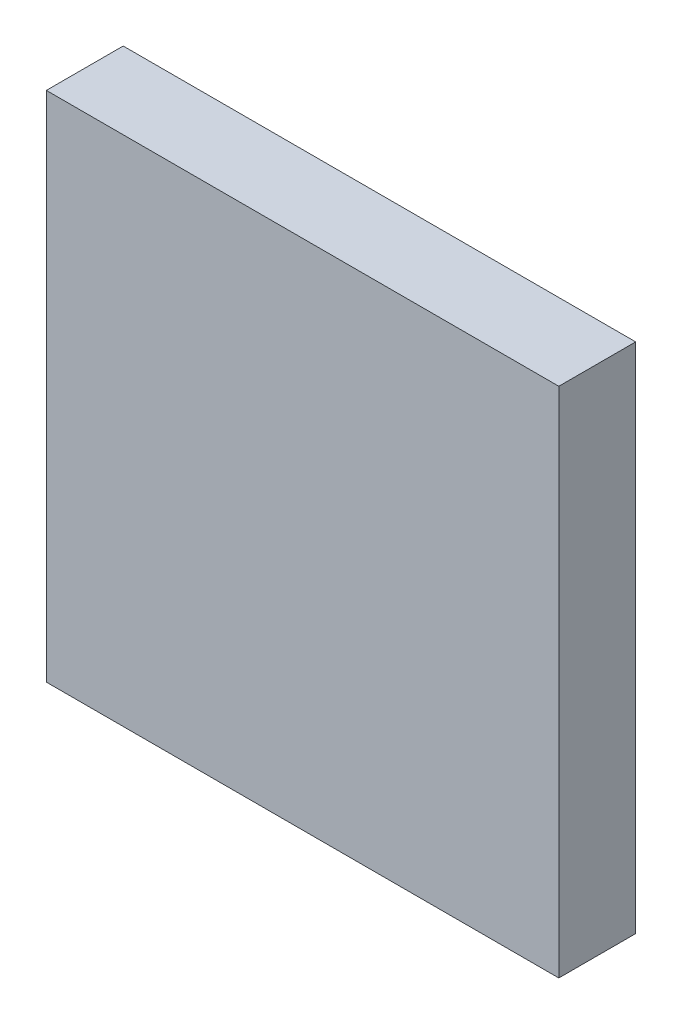
ISO-10303-21;
HEADER;
FILE_DESCRIPTION(('STEP AP214'),'2;1');
FILE_NAME('part.step','',(''),(''),'','','');
FILE_SCHEMA(('AUTOMOTIVE_DESIGN { 1 0 10303 214 1 1 1 1 }'));
ENDSEC;
DATA;
#1=APPLICATION_CONTEXT('core data for automotive mechanical design processes');
#2=APPLICATION_PROTOCOL_DEFINITION('international standard','automotive_design',2000,#1);
#3=PRODUCT_CONTEXT('',#1,'mechanical');
#4=PRODUCT('Part','Part','',(#3));
#5=PRODUCT_RELATED_PRODUCT_CATEGORY('part','',(#4));
#6=PRODUCT_DEFINITION_FORMATION('','',#4);
#7=PRODUCT_DEFINITION_CONTEXT('part definition',#1,'design');
#8=PRODUCT_DEFINITION('design','',#6,#7);
#9=PRODUCT_DEFINITION_SHAPE('','',#8);
#10=(LENGTH_UNIT() NAMED_UNIT(*) SI_UNIT(.MILLI.,.METRE.));
#11=(NAMED_UNIT(*) PLANE_ANGLE_UNIT() SI_UNIT($,.RADIAN.));
#12=(NAMED_UNIT(*) SI_UNIT($,.STERADIAN.) SOLID_ANGLE_UNIT());
#13=UNCERTAINTY_MEASURE_WITH_UNIT(LENGTH_MEASURE(1.E-05),#10,'distance_accuracy_value','');
#14=(GEOMETRIC_REPRESENTATION_CONTEXT(3) GLOBAL_UNCERTAINTY_ASSIGNED_CONTEXT((#13)) GLOBAL_UNIT_ASSIGNED_CONTEXT((#10,
#11,#12)) REPRESENTATION_CONTEXT('',''));
#15=CARTESIAN_POINT('',(0.,0.,0.));
#16=DIRECTION('',(0.,0.,1.));
#17=DIRECTION('',(1.,0.,0.));
#18=AXIS2_PLACEMENT_3D('',#15,#16,#17);
#19=CARTESIAN_POINT('',(0.,0.,3.));
#20=DIRECTION('',(1.,0.,0.));
#21=DIRECTION('',(0.,0.,-1.));
#22=AXIS2_PLACEMENT_3D('',#19,#20,#21);
#23=PLANE('',#22);
#24=DIRECTION('',(0.,-1.,0.));
#25=VECTOR('',#24,1.);
#26=CARTESIAN_POINT('',(0.,0.,0.));
#27=LINE('',#26,#25);
#28=CARTESIAN_POINT('',(0.,20.,0.));
#29=VERTEX_POINT('',#28);
#30=CARTESIAN_POINT('',(0.,0.,0.));
#31=VERTEX_POINT('',#30);
#32=EDGE_CURVE('E96',#29,#31,#27,.T.);
#33=ORIENTED_EDGE('',*,*,#32,.T.);
#34=DIRECTION('',(0.,0.,-1.));
#35=VECTOR('',#34,1.);
#36=CARTESIAN_POINT('',(0.,0.,3.));
#37=LINE('',#36,#35);
#38=CARTESIAN_POINT('',(0.,0.,3.));
#39=VERTEX_POINT('',#38);
#40=EDGE_CURVE('E11',#39,#31,#37,.T.);
#41=ORIENTED_EDGE('',*,*,#40,.F.);
#42=DIRECTION('',(0.,-1.,0.));
#43=VECTOR('',#42,1.);
#44=CARTESIAN_POINT('',(0.,0.,3.));
#45=LINE('',#44,#43);
#46=CARTESIAN_POINT('',(0.,20.,3.));
#47=VERTEX_POINT('',#46);
#48=EDGE_CURVE('E84',#47,#39,#45,.T.);
#49=ORIENTED_EDGE('',*,*,#48,.F.);
#50=DIRECTION('',(0.,0.,-1.));
#51=VECTOR('',#50,1.);
#52=CARTESIAN_POINT('',(0.,20.,3.));
#53=LINE('',#52,#51);
#54=EDGE_CURVE('E92',#47,#29,#53,.T.);
#55=ORIENTED_EDGE('',*,*,#54,.T.);
#56=EDGE_LOOP('',(#33,#41,#49,#55));
#57=FACE_BOUND('',#56,.T.);
#58=ADVANCED_FACE('F33',(#57),#23,.F.);
#59=CARTESIAN_POINT('',(0.,0.,3.));
#60=DIRECTION('',(0.,1.,0.));
#61=DIRECTION('',(0.,0.,1.));
#62=AXIS2_PLACEMENT_3D('',#59,#60,#61);
#63=PLANE('',#62);
#64=DIRECTION('',(1.,0.,0.));
#65=VECTOR('',#64,1.);
#66=CARTESIAN_POINT('',(0.,0.,0.));
#67=LINE('',#66,#65);
#68=CARTESIAN_POINT('',(20.,0.,0.));
#69=VERTEX_POINT('',#68);
#70=EDGE_CURVE('E88',#31,#69,#67,.T.);
#71=ORIENTED_EDGE('',*,*,#70,.T.);
#72=DIRECTION('',(0.,0.,-1.));
#73=VECTOR('',#72,1.);
#74=CARTESIAN_POINT('',(20.,0.,3.));
#75=LINE('',#74,#73);
#76=CARTESIAN_POINT('',(20.,0.,3.));
#77=VERTEX_POINT('',#76);
#78=EDGE_CURVE('E41',#77,#69,#75,.T.);
#79=ORIENTED_EDGE('',*,*,#78,.F.);
#80=DIRECTION('',(1.,0.,0.));
#81=VECTOR('',#80,1.);
#82=CARTESIAN_POINT('',(0.,0.,3.));
#83=LINE('',#82,#81);
#84=EDGE_CURVE('E79',#39,#77,#83,.T.);
#85=ORIENTED_EDGE('',*,*,#84,.F.);
#86=ORIENTED_EDGE('',*,*,#40,.T.);
#87=EDGE_LOOP('',(#71,#79,#85,#86));
#88=FACE_BOUND('',#87,.T.);
#89=ADVANCED_FACE('F87',(#88),#63,.F.);
#90=CARTESIAN_POINT('',(20.,0.,3.));
#91=DIRECTION('',(-1.,0.,0.));
#92=DIRECTION('',(0.,0.,1.));
#93=AXIS2_PLACEMENT_3D('',#90,#91,#92);
#94=PLANE('',#93);
#95=DIRECTION('',(0.,1.,0.));
#96=VECTOR('',#95,1.);
#97=CARTESIAN_POINT('',(20.,0.,0.));
#98=LINE('',#97,#96);
#99=CARTESIAN_POINT('',(20.,20.,0.));
#100=VERTEX_POINT('',#99);
#101=EDGE_CURVE('E66',#69,#100,#98,.T.);
#102=ORIENTED_EDGE('',*,*,#101,.T.);
#103=DIRECTION('',(0.,0.,-1.));
#104=VECTOR('',#103,1.);
#105=CARTESIAN_POINT('',(20.,20.,3.));
#106=LINE('',#105,#104);
#107=CARTESIAN_POINT('',(20.,20.,3.));
#108=VERTEX_POINT('',#107);
#109=EDGE_CURVE('E89',#108,#100,#106,.T.);
#110=ORIENTED_EDGE('',*,*,#109,.F.);
#111=DIRECTION('',(0.,1.,0.));
#112=VECTOR('',#111,1.);
#113=CARTESIAN_POINT('',(20.,0.,3.));
#114=LINE('',#113,#112);
#115=EDGE_CURVE('E82',#77,#108,#114,.T.);
#116=ORIENTED_EDGE('',*,*,#115,.F.);
#117=ORIENTED_EDGE('',*,*,#78,.T.);
#118=EDGE_LOOP('',(#102,#110,#116,#117));
#119=FACE_BOUND('',#118,.T.);
#120=ADVANCED_FACE('F90',(#119),#94,.F.);
#121=CARTESIAN_POINT('',(0.,20.,3.));
#122=DIRECTION('',(0.,-1.,0.));
#123=DIRECTION('',(0.,0.,-1.));
#124=AXIS2_PLACEMENT_3D('',#121,#122,#123);
#125=PLANE('',#124);
#126=DIRECTION('',(-1.,0.,0.));
#127=VECTOR('',#126,1.);
#128=CARTESIAN_POINT('',(0.,20.,0.));
#129=LINE('',#128,#127);
#130=EDGE_CURVE('E72',#100,#29,#129,.T.);
#131=ORIENTED_EDGE('',*,*,#130,.T.);
#132=ORIENTED_EDGE('',*,*,#54,.F.);
#133=DIRECTION('',(-1.,0.,0.));
#134=VECTOR('',#133,1.);
#135=CARTESIAN_POINT('',(0.,20.,3.));
#136=LINE('',#135,#134);
#137=EDGE_CURVE('E49',#108,#47,#136,.T.);
#138=ORIENTED_EDGE('',*,*,#137,.F.);
#139=ORIENTED_EDGE('',*,*,#109,.T.);
#140=EDGE_LOOP('',(#131,#132,#138,#139));
#141=FACE_BOUND('',#140,.T.);
#142=ADVANCED_FACE('F103',(#141),#125,.F.);
#143=CARTESIAN_POINT('',(0.,0.,3.));
#144=DIRECTION('',(0.,0.,-1.));
#145=DIRECTION('',(-1.,0.,0.));
#146=AXIS2_PLACEMENT_3D('',#143,#144,#145);
#147=PLANE('',#146);
#148=ORIENTED_EDGE('',*,*,#48,.T.);
#149=ORIENTED_EDGE('',*,*,#84,.T.);
#150=ORIENTED_EDGE('',*,*,#115,.T.);
#151=ORIENTED_EDGE('',*,*,#137,.T.);
#152=EDGE_LOOP('',(#148,#149,#150,#151));
#153=FACE_BOUND('',#152,.T.);
#154=ADVANCED_FACE('F80',(#153),#147,.F.);
#155=CARTESIAN_POINT('',(0.,0.,0.));
#156=DIRECTION('',(0.,0.,-1.));
#157=DIRECTION('',(-1.,0.,0.));
#158=AXIS2_PLACEMENT_3D('',#155,#156,#157);
#159=PLANE('',#158);
#160=ORIENTED_EDGE('',*,*,#32,.F.);
#161=ORIENTED_EDGE('',*,*,#130,.F.);
#162=ORIENTED_EDGE('',*,*,#101,.F.);
#163=ORIENTED_EDGE('',*,*,#70,.F.);
#164=EDGE_LOOP('',(#160,#161,#162,#163));
#165=FACE_BOUND('',#164,.T.);
#166=ADVANCED_FACE('F106',(#165),#159,.T.);
#167=CLOSED_SHELL('',(#58,#89,#120,#142,#154,#166));
#168=MANIFOLD_SOLID_BREP('B2',#167);
#169=ADVANCED_BREP_SHAPE_REPRESENTATION('',(#18,#168),#14);
#170=SHAPE_DEFINITION_REPRESENTATION(#9,#169);
ENDSEC;
END-ISO-10303-21;
